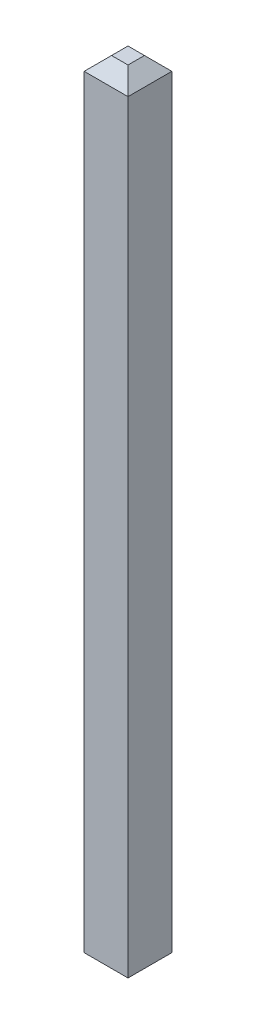
ISO-10303-21;
HEADER;
FILE_DESCRIPTION(('STEP AP214'),'2;1');
FILE_NAME('part.step','',(''),(''),'','','');
FILE_SCHEMA(('AUTOMOTIVE_DESIGN { 1 0 10303 214 1 1 1 1 }'));
ENDSEC;
DATA;
#1=APPLICATION_CONTEXT('core data for automotive mechanical design processes');
#2=APPLICATION_PROTOCOL_DEFINITION('international standard','automotive_design',2000,#1);
#3=PRODUCT_CONTEXT('',#1,'mechanical');
#4=PRODUCT('Part','Part','',(#3));
#5=PRODUCT_RELATED_PRODUCT_CATEGORY('part','',(#4));
#6=PRODUCT_DEFINITION_FORMATION('','',#4);
#7=PRODUCT_DEFINITION_CONTEXT('part definition',#1,'design');
#8=PRODUCT_DEFINITION('design','',#6,#7);
#9=PRODUCT_DEFINITION_SHAPE('','',#8);
#10=(LENGTH_UNIT() NAMED_UNIT(*) SI_UNIT(.MILLI.,.METRE.));
#11=(NAMED_UNIT(*) PLANE_ANGLE_UNIT() SI_UNIT($,.RADIAN.));
#12=(NAMED_UNIT(*) SI_UNIT($,.STERADIAN.) SOLID_ANGLE_UNIT());
#13=UNCERTAINTY_MEASURE_WITH_UNIT(LENGTH_MEASURE(1.E-05),#10,'distance_accuracy_value','');
#14=(GEOMETRIC_REPRESENTATION_CONTEXT(3) GLOBAL_UNCERTAINTY_ASSIGNED_CONTEXT((#13)) GLOBAL_UNIT_ASSIGNED_CONTEXT((#10,
#11,#12)) REPRESENTATION_CONTEXT('',''));
#15=CARTESIAN_POINT('',(0.,0.,0.));
#16=DIRECTION('',(0.,0.,1.));
#17=DIRECTION('',(1.,0.,0.));
#18=AXIS2_PLACEMENT_3D('',#15,#16,#17);
#19=CARTESIAN_POINT('',(-3.49,7.07,-0.32));
#20=DIRECTION('',(-0.707106781186548,-0.707106781186548,0.));
#21=DIRECTION('',(-0.707106781186548,0.707106781186548,0.));
#22=AXIS2_PLACEMENT_3D('',#19,#20,#21);
#23=PLANE('',#22);
#24=DIRECTION('',(0.577350269189626,-0.577350269189626,0.577350269189626));
#25=VECTOR('',#24,1.);
#26=CARTESIAN_POINT('',(-3.703333333333,7.283333333333,0.106666666667));
#27=LINE('',#26,#25);
#28=CARTESIAN_POINT('',(-3.69,7.27,0.12));
#29=VERTEX_POINT('',#28);
#30=CARTESIAN_POINT('',(-3.49,7.07,0.32));
#31=VERTEX_POINT('',#30);
#32=EDGE_CURVE('E151',#29,#31,#27,.T.);
#33=ORIENTED_EDGE('',*,*,#32,.T.);
#34=DIRECTION('',(0.,0.,1.));
#35=VECTOR('',#34,1.);
#36=CARTESIAN_POINT('',(-3.49,7.07,-0.32));
#37=LINE('',#36,#35);
#38=CARTESIAN_POINT('',(-3.49,7.07,-0.32));
#39=VERTEX_POINT('',#38);
#40=EDGE_CURVE('E157',#39,#31,#37,.T.);
#41=ORIENTED_EDGE('',*,*,#40,.F.);
#42=DIRECTION('',(0.577350269189626,-0.577350269189626,-0.577350269189626));
#43=VECTOR('',#42,1.);
#44=CARTESIAN_POINT('',(-3.49,7.07,-0.32));
#45=LINE('',#44,#43);
#46=CARTESIAN_POINT('',(-3.69,7.27,-0.12));
#47=VERTEX_POINT('',#46);
#48=EDGE_CURVE('E11',#47,#39,#45,.T.);
#49=ORIENTED_EDGE('',*,*,#48,.F.);
#50=DIRECTION('',(0.,0.,-1.));
#51=VECTOR('',#50,1.);
#52=CARTESIAN_POINT('',(-3.69,7.27,-0.32));
#53=LINE('',#52,#51);
#54=EDGE_CURVE('E20',#29,#47,#53,.T.);
#55=ORIENTED_EDGE('',*,*,#54,.F.);
#56=EDGE_LOOP('',(#33,#41,#49,#55));
#57=FACE_BOUND('',#56,.T.);
#58=ADVANCED_FACE('F16',(#57),#23,.F.);
#59=CARTESIAN_POINT('',(-3.81,7.07,-0.32));
#60=DIRECTION('',(0.,0.707106781186548,-0.707106781186548));
#61=DIRECTION('',(-1.,0.,0.));
#62=AXIS2_PLACEMENT_3D('',#59,#60,#61);
#63=PLANE('',#62);
#64=DIRECTION('',(0.577350269189626,0.577350269189626,0.577350269189626));
#65=VECTOR('',#64,1.);
#66=CARTESIAN_POINT('',(-3.996666666667,7.203333333333,-0.186666666667));
#67=LINE('',#66,#65);
#68=CARTESIAN_POINT('',(-4.13,7.07,-0.32));
#69=VERTEX_POINT('',#68);
#70=CARTESIAN_POINT('',(-3.93,7.27,-0.12));
#71=VERTEX_POINT('',#70);
#72=EDGE_CURVE('E27',#69,#71,#67,.T.);
#73=ORIENTED_EDGE('',*,*,#72,.T.);
#74=DIRECTION('',(-1.,0.,0.));
#75=VECTOR('',#74,1.);
#76=CARTESIAN_POINT('',(-4.13,7.27,-0.12));
#77=LINE('',#76,#75);
#78=EDGE_CURVE('E197',#47,#71,#77,.T.);
#79=ORIENTED_EDGE('',*,*,#78,.F.);
#80=ORIENTED_EDGE('',*,*,#48,.T.);
#81=DIRECTION('',(1.,0.,0.));
#82=VECTOR('',#81,1.);
#83=CARTESIAN_POINT('',(-3.49,7.07,-0.32));
#84=LINE('',#83,#82);
#85=EDGE_CURVE('E164',#69,#39,#84,.T.);
#86=ORIENTED_EDGE('',*,*,#85,.F.);
#87=EDGE_LOOP('',(#73,#79,#80,#86));
#88=FACE_BOUND('',#87,.T.);
#89=ADVANCED_FACE('F260',(#88),#63,.T.);
#90=CARTESIAN_POINT('',(-3.93,7.27,-0.32));
#91=DIRECTION('',(0.707106781186548,-0.707106781186548,0.));
#92=DIRECTION('',(0.,0.,-1.));
#93=AXIS2_PLACEMENT_3D('',#90,#91,#92);
#94=PLANE('',#93);
#95=DIRECTION('',(-0.577350269189626,-0.577350269189626,0.577350269189626));
#96=VECTOR('',#95,1.);
#97=CARTESIAN_POINT('',(-3.996666666667,7.203333333333,0.186666666667));
#98=LINE('',#97,#96);
#99=CARTESIAN_POINT('',(-3.93,7.27,0.12));
#100=VERTEX_POINT('',#99);
#101=CARTESIAN_POINT('',(-4.13,7.07,0.32));
#102=VERTEX_POINT('',#101);
#103=EDGE_CURVE('E41',#100,#102,#98,.T.);
#104=ORIENTED_EDGE('',*,*,#103,.F.);
#105=DIRECTION('',(0.,0.,1.));
#106=VECTOR('',#105,1.);
#107=CARTESIAN_POINT('',(-3.93,7.27,-0.32));
#108=LINE('',#107,#106);
#109=EDGE_CURVE('E193',#71,#100,#108,.T.);
#110=ORIENTED_EDGE('',*,*,#109,.F.);
#111=ORIENTED_EDGE('',*,*,#72,.F.);
#112=DIRECTION('',(0.,0.,-1.));
#113=VECTOR('',#112,1.);
#114=CARTESIAN_POINT('',(-4.13,7.07,-0.32));
#115=LINE('',#114,#113);
#116=EDGE_CURVE('E176',#102,#69,#115,.T.);
#117=ORIENTED_EDGE('',*,*,#116,.F.);
#118=EDGE_LOOP('',(#104,#110,#111,#117));
#119=FACE_BOUND('',#118,.T.);
#120=ADVANCED_FACE('F265',(#119),#94,.F.);
#121=CARTESIAN_POINT('',(-4.13,7.27,0.12));
#122=DIRECTION('',(0.,-0.707106781186548,-0.707106781186548));
#123=DIRECTION('',(0.,-0.707106781186548,0.707106781186548));
#124=AXIS2_PLACEMENT_3D('',#121,#122,#123);
#125=PLANE('',#124);
#126=ORIENTED_EDGE('',*,*,#32,.F.);
#127=DIRECTION('',(1.,0.,0.));
#128=VECTOR('',#127,1.);
#129=CARTESIAN_POINT('',(-4.13,7.27,0.12));
#130=LINE('',#129,#128);
#131=EDGE_CURVE('E153',#100,#29,#130,.T.);
#132=ORIENTED_EDGE('',*,*,#131,.F.);
#133=ORIENTED_EDGE('',*,*,#103,.T.);
#134=DIRECTION('',(-1.,0.,0.));
#135=VECTOR('',#134,1.);
#136=CARTESIAN_POINT('',(-3.81,7.07,0.32));
#137=LINE('',#136,#135);
#138=EDGE_CURVE('E154',#31,#102,#137,.T.);
#139=ORIENTED_EDGE('',*,*,#138,.F.);
#140=EDGE_LOOP('',(#126,#132,#133,#139));
#141=FACE_BOUND('',#140,.T.);
#142=ADVANCED_FACE('F18',(#141),#125,.F.);
#143=CARTESIAN_POINT('',(-4.13,7.27,-0.32));
#144=DIRECTION('',(0.,-1.,0.));
#145=DIRECTION('',(0.,0.,-1.));
#146=AXIS2_PLACEMENT_3D('',#143,#144,#145);
#147=PLANE('',#146);
#148=ORIENTED_EDGE('',*,*,#54,.T.);
#149=ORIENTED_EDGE('',*,*,#78,.T.);
#150=ORIENTED_EDGE('',*,*,#109,.T.);
#151=ORIENTED_EDGE('',*,*,#131,.T.);
#152=EDGE_LOOP('',(#148,#149,#150,#151));
#153=FACE_BOUND('',#152,.T.);
#154=ADVANCED_FACE('F221',(#153),#147,.F.);
#155=CARTESIAN_POINT('',(-3.49,7.27,-0.32));
#156=DIRECTION('',(-1.,0.,0.));
#157=DIRECTION('',(0.,1.,0.));
#158=AXIS2_PLACEMENT_3D('',#155,#156,#157);
#159=PLANE('',#158);
#160=DIRECTION('',(0.,-1.,0.));
#161=VECTOR('',#160,1.);
#162=CARTESIAN_POINT('',(-3.49,7.27,-0.32));
#163=LINE('',#162,#161);
#164=CARTESIAN_POINT('',(-3.49,-4.07,-0.32));
#165=VERTEX_POINT('',#164);
#166=EDGE_CURVE('E169',#39,#165,#163,.T.);
#167=ORIENTED_EDGE('',*,*,#166,.F.);
#168=ORIENTED_EDGE('',*,*,#40,.T.);
#169=DIRECTION('',(0.,-1.,0.));
#170=VECTOR('',#169,1.);
#171=CARTESIAN_POINT('',(-3.49,7.27,0.32));
#172=LINE('',#171,#170);
#173=CARTESIAN_POINT('',(-3.49,-4.07,0.32));
#174=VERTEX_POINT('',#173);
#175=EDGE_CURVE('E101',#31,#174,#172,.T.);
#176=ORIENTED_EDGE('',*,*,#175,.T.);
#177=DIRECTION('',(0.,0.,-1.));
#178=VECTOR('',#177,1.);
#179=CARTESIAN_POINT('',(-3.49,-4.07,-0.32));
#180=LINE('',#179,#178);
#181=EDGE_CURVE('E64',#174,#165,#180,.T.);
#182=ORIENTED_EDGE('',*,*,#181,.T.);
#183=EDGE_LOOP('',(#167,#168,#176,#182));
#184=FACE_BOUND('',#183,.T.);
#185=ADVANCED_FACE('F243',(#184),#159,.F.);
#186=CARTESIAN_POINT('',(-3.81,1.5,0.32));
#187=DIRECTION('',(0.,0.,-1.));
#188=DIRECTION('',(0.,-1.,0.));
#189=AXIS2_PLACEMENT_3D('',#186,#187,#188);
#190=PLANE('',#189);
#191=ORIENTED_EDGE('',*,*,#175,.F.);
#192=ORIENTED_EDGE('',*,*,#138,.T.);
#193=DIRECTION('',(0.,1.,0.));
#194=VECTOR('',#193,1.);
#195=CARTESIAN_POINT('',(-4.13,-4.27,0.32));
#196=LINE('',#195,#194);
#197=CARTESIAN_POINT('',(-4.13,-4.07,0.32));
#198=VERTEX_POINT('',#197);
#199=EDGE_CURVE('E172',#198,#102,#196,.T.);
#200=ORIENTED_EDGE('',*,*,#199,.F.);
#201=DIRECTION('',(1.,0.,0.));
#202=VECTOR('',#201,1.);
#203=CARTESIAN_POINT('',(-3.81,-4.07,0.32));
#204=LINE('',#203,#202);
#205=EDGE_CURVE('E117',#198,#174,#204,.T.);
#206=ORIENTED_EDGE('',*,*,#205,.T.);
#207=EDGE_LOOP('',(#191,#192,#200,#206));
#208=FACE_BOUND('',#207,.T.);
#209=ADVANCED_FACE('F245',(#208),#190,.F.);
#210=CARTESIAN_POINT('',(-3.69,-4.27,-0.32));
#211=DIRECTION('',(-0.707106781186548,0.707106781186548,0.));
#212=DIRECTION('',(0.,0.,1.));
#213=AXIS2_PLACEMENT_3D('',#210,#211,#212);
#214=PLANE('',#213);
#215=DIRECTION('',(-0.577350269189626,-0.577350269189626,0.577350269189626));
#216=VECTOR('',#215,1.);
#217=CARTESIAN_POINT('',(-3.623333333333,-4.203333333333,-0.186666666667));
#218=LINE('',#217,#216);
#219=CARTESIAN_POINT('',(-3.69,-4.27,-0.12));
#220=VERTEX_POINT('',#219);
#221=EDGE_CURVE('E165',#165,#220,#218,.T.);
#222=ORIENTED_EDGE('',*,*,#221,.F.);
#223=ORIENTED_EDGE('',*,*,#181,.F.);
#224=DIRECTION('',(-0.577350269189626,-0.577350269189626,-0.577350269189626));
#225=VECTOR('',#224,1.);
#226=CARTESIAN_POINT('',(-3.836666666667,-4.416666666667,-0.02666666666667));
#227=LINE('',#226,#225);
#228=CARTESIAN_POINT('',(-3.69,-4.27,0.12));
#229=VERTEX_POINT('',#228);
#230=EDGE_CURVE('E124',#174,#229,#227,.T.);
#231=ORIENTED_EDGE('',*,*,#230,.T.);
#232=DIRECTION('',(0.,0.,1.));
#233=VECTOR('',#232,1.);
#234=CARTESIAN_POINT('',(-3.69,-4.27,-0.32));
#235=LINE('',#234,#233);
#236=EDGE_CURVE('E129',#220,#229,#235,.T.);
#237=ORIENTED_EDGE('',*,*,#236,.F.);
#238=EDGE_LOOP('',(#222,#223,#231,#237));
#239=FACE_BOUND('',#238,.T.);
#240=ADVANCED_FACE('F127',(#239),#214,.F.);
#241=CARTESIAN_POINT('',(-3.49,-4.27,0.12));
#242=DIRECTION('',(0.,0.707106781186548,-0.707106781186548));
#243=DIRECTION('',(-1.,0.,0.));
#244=AXIS2_PLACEMENT_3D('',#241,#242,#243);
#245=PLANE('',#244);
#246=ORIENTED_EDGE('',*,*,#230,.F.);
#247=ORIENTED_EDGE('',*,*,#205,.F.);
#248=DIRECTION('',(-0.577350269189626,0.577350269189626,0.577350269189626));
#249=VECTOR('',#248,1.);
#250=CARTESIAN_POINT('',(-3.916666666667,-4.283333333333,0.106666666667));
#251=LINE('',#250,#249);
#252=CARTESIAN_POINT('',(-3.93,-4.27,0.12));
#253=VERTEX_POINT('',#252);
#254=EDGE_CURVE('E131',#253,#198,#251,.T.);
#255=ORIENTED_EDGE('',*,*,#254,.F.);
#256=DIRECTION('',(-1.,0.,0.));
#257=VECTOR('',#256,1.);
#258=CARTESIAN_POINT('',(-3.49,-4.27,0.12));
#259=LINE('',#258,#257);
#260=EDGE_CURVE('E133',#229,#253,#259,.T.);
#261=ORIENTED_EDGE('',*,*,#260,.F.);
#262=EDGE_LOOP('',(#246,#247,#255,#261));
#263=FACE_BOUND('',#262,.T.);
#264=ADVANCED_FACE('F134',(#263),#245,.F.);
#265=CARTESIAN_POINT('',(-4.13,-4.07,-0.32));
#266=DIRECTION('',(0.707106781186548,0.707106781186548,0.));
#267=DIRECTION('',(0.,0.,-1.));
#268=AXIS2_PLACEMENT_3D('',#265,#266,#267);
#269=PLANE('',#268);
#270=DIRECTION('',(0.577350269189626,-0.577350269189626,0.577350269189626));
#271=VECTOR('',#270,1.);
#272=CARTESIAN_POINT('',(-4.023333333333,-4.176666666667,-0.213333333333));
#273=LINE('',#272,#271);
#274=CARTESIAN_POINT('',(-4.13,-4.07,-0.32));
#275=VERTEX_POINT('',#274);
#276=CARTESIAN_POINT('',(-3.93,-4.27,-0.12));
#277=VERTEX_POINT('',#276);
#278=EDGE_CURVE('E87',#275,#277,#273,.T.);
#279=ORIENTED_EDGE('',*,*,#278,.T.);
#280=DIRECTION('',(0.,0.,-1.));
#281=VECTOR('',#280,1.);
#282=CARTESIAN_POINT('',(-3.93,-4.27,-0.32));
#283=LINE('',#282,#281);
#284=EDGE_CURVE('E138',#253,#277,#283,.T.);
#285=ORIENTED_EDGE('',*,*,#284,.F.);
#286=ORIENTED_EDGE('',*,*,#254,.T.);
#287=DIRECTION('',(0.,0.,1.));
#288=VECTOR('',#287,1.);
#289=CARTESIAN_POINT('',(-4.13,-4.07,-0.32));
#290=LINE('',#289,#288);
#291=EDGE_CURVE('E78',#275,#198,#290,.T.);
#292=ORIENTED_EDGE('',*,*,#291,.F.);
#293=EDGE_LOOP('',(#279,#285,#286,#292));
#294=FACE_BOUND('',#293,.T.);
#295=ADVANCED_FACE('F249',(#294),#269,.F.);
#296=CARTESIAN_POINT('',(-4.13,-4.27,-0.32));
#297=DIRECTION('',(1.,0.,0.));
#298=DIRECTION('',(0.,0.,1.));
#299=AXIS2_PLACEMENT_3D('',#296,#297,#298);
#300=PLANE('',#299);
#301=ORIENTED_EDGE('',*,*,#199,.T.);
#302=ORIENTED_EDGE('',*,*,#116,.T.);
#303=DIRECTION('',(0.,1.,0.));
#304=VECTOR('',#303,1.);
#305=CARTESIAN_POINT('',(-4.13,-4.27,-0.32));
#306=LINE('',#305,#304);
#307=EDGE_CURVE('E160',#275,#69,#306,.T.);
#308=ORIENTED_EDGE('',*,*,#307,.F.);
#309=ORIENTED_EDGE('',*,*,#291,.T.);
#310=EDGE_LOOP('',(#301,#302,#308,#309));
#311=FACE_BOUND('',#310,.T.);
#312=ADVANCED_FACE('F246',(#311),#300,.F.);
#313=CARTESIAN_POINT('',(-3.81,1.5,-0.32));
#314=DIRECTION('',(0.,0.,-1.));
#315=DIRECTION('',(0.,-1.,0.));
#316=AXIS2_PLACEMENT_3D('',#313,#314,#315);
#317=PLANE('',#316);
#318=ORIENTED_EDGE('',*,*,#307,.T.);
#319=ORIENTED_EDGE('',*,*,#85,.T.);
#320=ORIENTED_EDGE('',*,*,#166,.T.);
#321=DIRECTION('',(-1.,0.,0.));
#322=VECTOR('',#321,1.);
#323=CARTESIAN_POINT('',(-4.13,-4.07,-0.32));
#324=LINE('',#323,#322);
#325=EDGE_CURVE('E178',#165,#275,#324,.T.);
#326=ORIENTED_EDGE('',*,*,#325,.T.);
#327=EDGE_LOOP('',(#318,#319,#320,#326));
#328=FACE_BOUND('',#327,.T.);
#329=ADVANCED_FACE('F248',(#328),#317,.T.);
#330=CARTESIAN_POINT('',(-3.81,-4.07,-0.32));
#331=DIRECTION('',(0.,-0.707106781186548,-0.707106781186548));
#332=DIRECTION('',(0.,-0.707106781186548,0.707106781186548));
#333=AXIS2_PLACEMENT_3D('',#330,#331,#332);
#334=PLANE('',#333);
#335=ORIENTED_EDGE('',*,*,#278,.F.);
#336=ORIENTED_EDGE('',*,*,#325,.F.);
#337=ORIENTED_EDGE('',*,*,#221,.T.);
#338=DIRECTION('',(1.,0.,0.));
#339=VECTOR('',#338,1.);
#340=CARTESIAN_POINT('',(-3.49,-4.27,-0.12));
#341=LINE('',#340,#339);
#342=EDGE_CURVE('E142',#277,#220,#341,.T.);
#343=ORIENTED_EDGE('',*,*,#342,.F.);
#344=EDGE_LOOP('',(#335,#336,#337,#343));
#345=FACE_BOUND('',#344,.T.);
#346=ADVANCED_FACE('F256',(#345),#334,.T.);
#347=CARTESIAN_POINT('',(-3.49,-4.27,-0.32));
#348=DIRECTION('',(0.,1.,0.));
#349=DIRECTION('',(0.,0.,-1.));
#350=AXIS2_PLACEMENT_3D('',#347,#348,#349);
#351=PLANE('',#350);
#352=ORIENTED_EDGE('',*,*,#236,.T.);
#353=ORIENTED_EDGE('',*,*,#260,.T.);
#354=ORIENTED_EDGE('',*,*,#284,.T.);
#355=ORIENTED_EDGE('',*,*,#342,.T.);
#356=EDGE_LOOP('',(#352,#353,#354,#355));
#357=FACE_BOUND('',#356,.T.);
#358=ADVANCED_FACE('F141',(#357),#351,.F.);
#359=CLOSED_SHELL('',(#58,#89,#120,#142,#154,#185,#209,#240,#264,#295,#312,#329,#346,#358));
#360=MANIFOLD_SOLID_BREP('B1',#359);
#361=ADVANCED_BREP_SHAPE_REPRESENTATION('',(#18,#360),#14);
#362=SHAPE_DEFINITION_REPRESENTATION(#9,#361);
ENDSEC;
END-ISO-10303-21;
